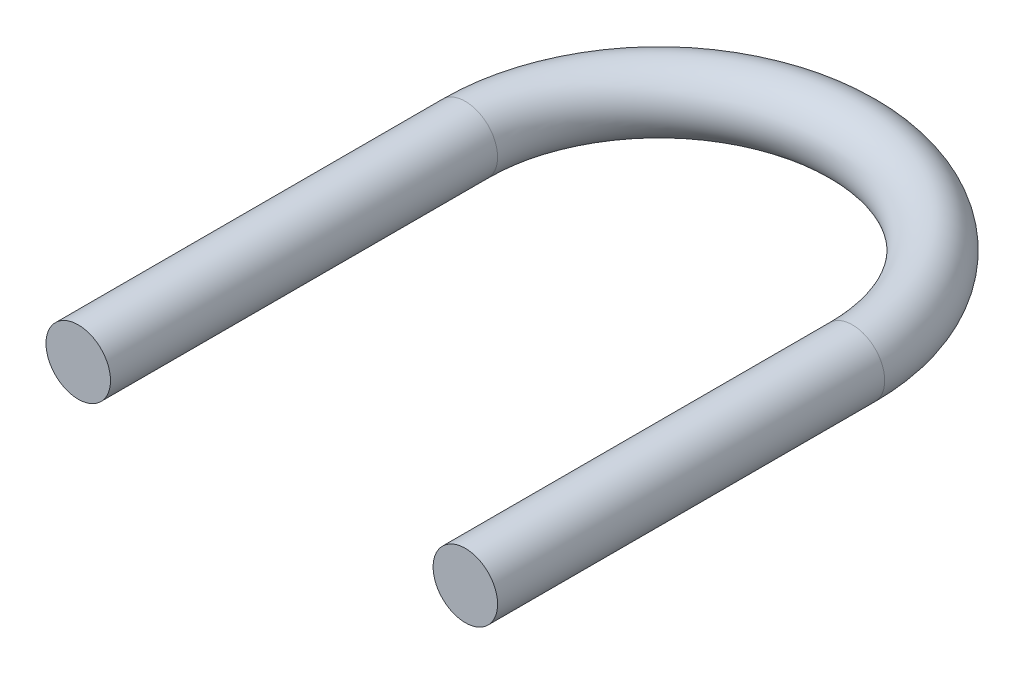
ISO-10303-21;
HEADER;
FILE_DESCRIPTION(('STEP AP214'),'2;1');
FILE_NAME('part.step','',(''),(''),'','','');
FILE_SCHEMA(('AUTOMOTIVE_DESIGN { 1 0 10303 214 1 1 1 1 }'));
ENDSEC;
DATA;
#1=APPLICATION_CONTEXT('core data for automotive mechanical design processes');
#2=APPLICATION_PROTOCOL_DEFINITION('international standard','automotive_design',2000,#1);
#3=PRODUCT_CONTEXT('',#1,'mechanical');
#4=PRODUCT('Part','Part','',(#3));
#5=PRODUCT_RELATED_PRODUCT_CATEGORY('part','',(#4));
#6=PRODUCT_DEFINITION_FORMATION('','',#4);
#7=PRODUCT_DEFINITION_CONTEXT('part definition',#1,'design');
#8=PRODUCT_DEFINITION('design','',#6,#7);
#9=PRODUCT_DEFINITION_SHAPE('','',#8);
#10=(LENGTH_UNIT() NAMED_UNIT(*) SI_UNIT(.MILLI.,.METRE.));
#11=(NAMED_UNIT(*) PLANE_ANGLE_UNIT() SI_UNIT($,.RADIAN.));
#12=(NAMED_UNIT(*) SI_UNIT($,.STERADIAN.) SOLID_ANGLE_UNIT());
#13=UNCERTAINTY_MEASURE_WITH_UNIT(LENGTH_MEASURE(1.E-05),#10,'distance_accuracy_value','');
#14=(GEOMETRIC_REPRESENTATION_CONTEXT(3) GLOBAL_UNCERTAINTY_ASSIGNED_CONTEXT((#13)) GLOBAL_UNIT_ASSIGNED_CONTEXT((#10,
#11,#12)) REPRESENTATION_CONTEXT('',''));
#15=CARTESIAN_POINT('',(0.,0.,0.));
#16=DIRECTION('',(0.,0.,1.));
#17=DIRECTION('',(1.,0.,0.));
#18=AXIS2_PLACEMENT_3D('',#15,#16,#17);
#19=CARTESIAN_POINT('',(330.2,1676.4,-419.1));
#20=DIRECTION('',(0.,0.,1.));
#21=DIRECTION('',(1.,0.,0.));
#22=AXIS2_PLACEMENT_3D('',#19,#20,#21);
#23=PLANE('',#22);
#24=CARTESIAN_POINT('',(330.2,1676.4,-419.1));
#25=DIRECTION('',(0.,0.,1.));
#26=DIRECTION('',(1.,0.,0.));
#27=AXIS2_PLACEMENT_3D('',#24,#25,#26);
#28=CIRCLE('',#27,25.4);
#29=CARTESIAN_POINT('',(355.6,1676.4,-419.1));
#30=VERTEX_POINT('',#29);
#31=EDGE_CURVE('E44',#30,#30,#28,.T.);
#32=ORIENTED_EDGE('',*,*,#31,.T.);
#33=EDGE_LOOP('',(#32));
#34=FACE_BOUND('',#33,.T.);
#35=ADVANCED_FACE('F37',(#34),#23,.T.);
#36=CARTESIAN_POINT('',(330.2,1676.4,-419.1));
#37=DIRECTION('',(0.,0.,-1.));
#38=DIRECTION('',(-1.,0.,0.));
#39=AXIS2_PLACEMENT_3D('',#36,#37,#38);
#40=CYLINDRICAL_SURFACE('',#39,25.4);
#41=CARTESIAN_POINT('',(330.2,1676.4,-723.9));
#42=DIRECTION('',(0.,0.,1.));
#43=DIRECTION('',(1.,0.,0.));
#44=AXIS2_PLACEMENT_3D('',#41,#42,#43);
#45=CIRCLE('',#44,25.4);
#46=CARTESIAN_POINT('',(355.6,1676.4,-723.9));
#47=VERTEX_POINT('',#46);
#48=EDGE_CURVE('E10',#47,#47,#45,.T.);
#49=ORIENTED_EDGE('',*,*,#48,.T.);
#50=EDGE_LOOP('',(#49));
#51=FACE_BOUND('',#50,.T.);
#52=ORIENTED_EDGE('',*,*,#31,.F.);
#53=EDGE_LOOP('',(#52));
#54=FACE_BOUND('',#53,.T.);
#55=ADVANCED_FACE('F74',(#51,#54),#40,.T.);
#56=CARTESIAN_POINT('',(25.4,1676.4,-419.1));
#57=DIRECTION('',(0.,0.,1.));
#58=DIRECTION('',(1.,0.,0.));
#59=AXIS2_PLACEMENT_3D('',#56,#57,#58);
#60=PLANE('',#59);
#61=CARTESIAN_POINT('',(25.4,1676.4,-419.1));
#62=DIRECTION('',(0.,0.,1.));
#63=DIRECTION('',(1.,0.,0.));
#64=AXIS2_PLACEMENT_3D('',#61,#62,#63);
#65=CIRCLE('',#64,25.4);
#66=CARTESIAN_POINT('',(50.8,1676.4,-419.1));
#67=VERTEX_POINT('',#66);
#68=EDGE_CURVE('E54',#67,#67,#65,.T.);
#69=ORIENTED_EDGE('',*,*,#68,.T.);
#70=EDGE_LOOP('',(#69));
#71=FACE_BOUND('',#70,.T.);
#72=ADVANCED_FACE('F61',(#71),#60,.T.);
#73=CARTESIAN_POINT('',(25.4,1676.4,-419.1));
#74=DIRECTION('',(0.,0.,-1.));
#75=DIRECTION('',(-1.,0.,0.));
#76=AXIS2_PLACEMENT_3D('',#73,#74,#75);
#77=CYLINDRICAL_SURFACE('',#76,25.4);
#78=CARTESIAN_POINT('',(25.4,1676.4,-723.9));
#79=DIRECTION('',(0.,0.,1.));
#80=DIRECTION('',(1.,0.,0.));
#81=AXIS2_PLACEMENT_3D('',#78,#79,#80);
#82=CIRCLE('',#81,25.4);
#83=CARTESIAN_POINT('',(0.,1676.4,-723.9));
#84=VERTEX_POINT('',#83);
#85=EDGE_CURVE('E49',#84,#84,#82,.T.);
#86=ORIENTED_EDGE('',*,*,#85,.T.);
#87=EDGE_LOOP('',(#86));
#88=FACE_BOUND('',#87,.T.);
#89=ORIENTED_EDGE('',*,*,#68,.F.);
#90=EDGE_LOOP('',(#89));
#91=FACE_BOUND('',#90,.T.);
#92=ADVANCED_FACE('F63',(#88,#91),#77,.T.);
#93=CARTESIAN_POINT('',(177.8,1676.4,-723.9));
#94=DIRECTION('',(0.,-1.,0.));
#95=DIRECTION('',(0.,0.,-1.));
#96=AXIS2_PLACEMENT_3D('',#93,#94,#95);
#97=TOROIDAL_SURFACE('',#96,152.4,25.4);
#98=CARTESIAN_POINT('',(177.8,1676.4,-723.9));
#99=DIRECTION('',(0.,-1.,0.));
#100=DIRECTION('',(0.,0.,-1.));
#101=AXIS2_PLACEMENT_3D('',#98,#99,#100);
#102=CIRCLE('',#101,177.8);
#103=EDGE_CURVE('',#84,#47,#102,.T.);
#104=ORIENTED_EDGE('',*,*,#85,.F.);
#105=ORIENTED_EDGE('',*,*,#48,.F.);
#106=ORIENTED_EDGE('',*,*,#103,.T.);
#107=ORIENTED_EDGE('',*,*,#103,.F.);
#108=EDGE_LOOP('',(#104,#106,#105,#107));
#109=FACE_BOUND('',#108,.T.);
#110=ADVANCED_FACE('F65',(#109),#97,.T.);
#111=CLOSED_SHELL('',(#35,#55,#72,#92,#110));
#112=MANIFOLD_SOLID_BREP('B2',#111);
#113=ADVANCED_BREP_SHAPE_REPRESENTATION('',(#18,#112),#14);
#114=SHAPE_DEFINITION_REPRESENTATION(#9,#113);
ENDSEC;
END-ISO-10303-21;
